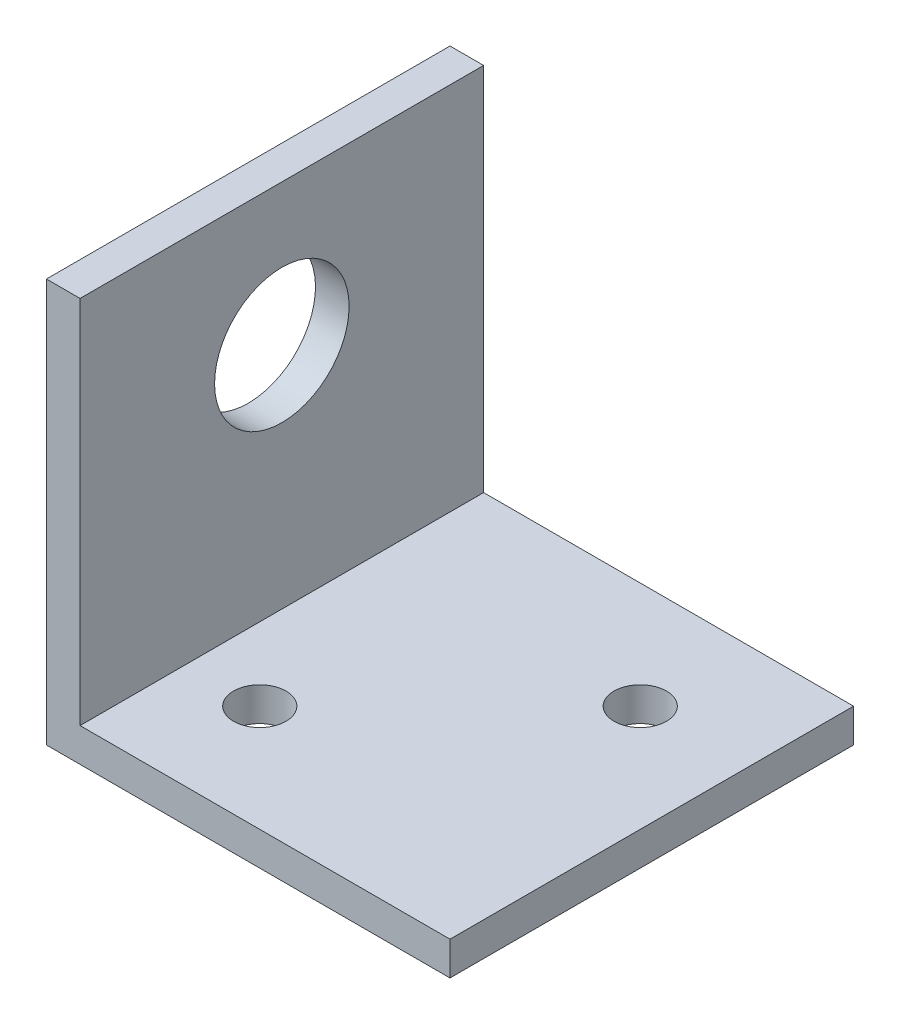
ISO-10303-21;
HEADER;
FILE_DESCRIPTION(('STEP AP214'),'2;1');
FILE_NAME('part.step','',(''),(''),'','','');
FILE_SCHEMA(('AUTOMOTIVE_DESIGN { 1 0 10303 214 1 1 1 1 }'));
ENDSEC;
DATA;
#1=APPLICATION_CONTEXT('core data for automotive mechanical design processes');
#2=APPLICATION_PROTOCOL_DEFINITION('international standard','automotive_design',2000,#1);
#3=PRODUCT_CONTEXT('',#1,'mechanical');
#4=PRODUCT('Part','Part','',(#3));
#5=PRODUCT_RELATED_PRODUCT_CATEGORY('part','',(#4));
#6=PRODUCT_DEFINITION_FORMATION('','',#4);
#7=PRODUCT_DEFINITION_CONTEXT('part definition',#1,'design');
#8=PRODUCT_DEFINITION('design','',#6,#7);
#9=PRODUCT_DEFINITION_SHAPE('','',#8);
#10=(LENGTH_UNIT() NAMED_UNIT(*) SI_UNIT(.MILLI.,.METRE.));
#11=(NAMED_UNIT(*) PLANE_ANGLE_UNIT() SI_UNIT($,.RADIAN.));
#12=(NAMED_UNIT(*) SI_UNIT($,.STERADIAN.) SOLID_ANGLE_UNIT());
#13=UNCERTAINTY_MEASURE_WITH_UNIT(LENGTH_MEASURE(1.E-05),#10,'distance_accuracy_value','');
#14=(GEOMETRIC_REPRESENTATION_CONTEXT(3) GLOBAL_UNCERTAINTY_ASSIGNED_CONTEXT((#13)) GLOBAL_UNIT_ASSIGNED_CONTEXT((#10,
#11,#12)) REPRESENTATION_CONTEXT('',''));
#15=CARTESIAN_POINT('',(0.,0.,0.));
#16=DIRECTION('',(0.,0.,1.));
#17=DIRECTION('',(1.,0.,0.));
#18=AXIS2_PLACEMENT_3D('',#15,#16,#17);
#19=CARTESIAN_POINT('',(0.,0.,38.1));
#20=DIRECTION('',(0.,1.,0.));
#21=DIRECTION('',(0.,0.,1.));
#22=AXIS2_PLACEMENT_3D('',#19,#20,#21);
#23=PLANE('',#22);
#24=CARTESIAN_POINT('',(10.0697438789308,0.,28.0302561210691));
#25=DIRECTION('',(0.,-1.,0.));
#26=DIRECTION('',(0.,0.,-1.));
#27=AXIS2_PLACEMENT_3D('',#24,#25,#26);
#28=CIRCLE('',#27,2.4765);
#29=CARTESIAN_POINT('',(10.0697438789308,0.,25.5537561210691));
#30=VERTEX_POINT('',#29);
#31=EDGE_CURVE('E135',#30,#30,#28,.T.);
#32=ORIENTED_EDGE('',*,*,#31,.F.);
#33=EDGE_LOOP('',(#32));
#34=FACE_BOUND('',#33,.T.);
#35=CARTESIAN_POINT('',(28.0302561210692,0.,10.0697438789309));
#36=DIRECTION('',(0.,-1.,0.));
#37=DIRECTION('',(0.,0.,-1.));
#38=AXIS2_PLACEMENT_3D('',#35,#36,#37);
#39=CIRCLE('',#38,2.4765);
#40=CARTESIAN_POINT('',(28.0302561210692,0.,7.5932438789309));
#41=VERTEX_POINT('',#40);
#42=EDGE_CURVE('E141',#41,#41,#39,.T.);
#43=ORIENTED_EDGE('',*,*,#42,.F.);
#44=EDGE_LOOP('',(#43));
#45=FACE_BOUND('',#44,.T.);
#46=DIRECTION('',(1.,0.,0.));
#47=VECTOR('',#46,1.);
#48=CARTESIAN_POINT('',(0.,0.,0.));
#49=LINE('',#48,#47);
#50=CARTESIAN_POINT('',(0.,0.,0.));
#51=VERTEX_POINT('',#50);
#52=CARTESIAN_POINT('',(38.1,0.,0.));
#53=VERTEX_POINT('',#52);
#54=EDGE_CURVE('E116',#51,#53,#49,.T.);
#55=ORIENTED_EDGE('',*,*,#54,.T.);
#56=DIRECTION('',(0.,0.,-1.));
#57=VECTOR('',#56,1.);
#58=CARTESIAN_POINT('',(38.1,0.,38.1));
#59=LINE('',#58,#57);
#60=CARTESIAN_POINT('',(38.1,0.,38.1));
#61=VERTEX_POINT('',#60);
#62=EDGE_CURVE('E11',#61,#53,#59,.T.);
#63=ORIENTED_EDGE('',*,*,#62,.F.);
#64=DIRECTION('',(1.,0.,0.));
#65=VECTOR('',#64,1.);
#66=CARTESIAN_POINT('',(0.,0.,38.1));
#67=LINE('',#66,#65);
#68=CARTESIAN_POINT('',(0.,0.,38.1));
#69=VERTEX_POINT('',#68);
#70=EDGE_CURVE('E81',#69,#61,#67,.T.);
#71=ORIENTED_EDGE('',*,*,#70,.F.);
#72=DIRECTION('',(0.,0.,-1.));
#73=VECTOR('',#72,1.);
#74=CARTESIAN_POINT('',(0.,0.,38.1));
#75=LINE('',#74,#73);
#76=EDGE_CURVE('E112',#69,#51,#75,.T.);
#77=ORIENTED_EDGE('',*,*,#76,.T.);
#78=EDGE_LOOP('',(#55,#63,#71,#77));
#79=FACE_BOUND('',#78,.T.);
#80=ADVANCED_FACE('F33',(#34,#45,#79),#23,.F.);
#81=CARTESIAN_POINT('',(38.1,3.175,38.1));
#82=DIRECTION('',(1.,0.,0.));
#83=DIRECTION('',(0.,0.,-1.));
#84=AXIS2_PLACEMENT_3D('',#81,#82,#83);
#85=PLANE('',#84);
#86=DIRECTION('',(0.,-1.,0.));
#87=VECTOR('',#86,1.);
#88=CARTESIAN_POINT('',(38.1,3.175,0.));
#89=LINE('',#88,#87);
#90=CARTESIAN_POINT('',(38.1,3.175,0.));
#91=VERTEX_POINT('',#90);
#92=EDGE_CURVE('E119',#91,#53,#89,.T.);
#93=ORIENTED_EDGE('',*,*,#92,.F.);
#94=DIRECTION('',(0.,0.,-1.));
#95=VECTOR('',#94,1.);
#96=CARTESIAN_POINT('',(38.1,3.175,38.1));
#97=LINE('',#96,#95);
#98=CARTESIAN_POINT('',(38.1,3.175,38.1));
#99=VERTEX_POINT('',#98);
#100=EDGE_CURVE('E42',#99,#91,#97,.T.);
#101=ORIENTED_EDGE('',*,*,#100,.F.);
#102=DIRECTION('',(0.,-1.,0.));
#103=VECTOR('',#102,1.);
#104=CARTESIAN_POINT('',(38.1,3.175,38.1));
#105=LINE('',#104,#103);
#106=EDGE_CURVE('E153',#99,#61,#105,.T.);
#107=ORIENTED_EDGE('',*,*,#106,.T.);
#108=ORIENTED_EDGE('',*,*,#62,.T.);
#109=EDGE_LOOP('',(#93,#101,#107,#108));
#110=FACE_BOUND('',#109,.T.);
#111=ADVANCED_FACE('F176',(#110),#85,.T.);
#112=CARTESIAN_POINT('',(0.,3.175,38.1));
#113=DIRECTION('',(0.,1.,0.));
#114=DIRECTION('',(0.,0.,1.));
#115=AXIS2_PLACEMENT_3D('',#112,#113,#114);
#116=PLANE('',#115);
#117=CARTESIAN_POINT('',(10.0697438789308,3.175,28.0302561210691));
#118=DIRECTION('',(0.,1.,0.));
#119=DIRECTION('',(0.,0.,1.));
#120=AXIS2_PLACEMENT_3D('',#117,#118,#119);
#121=CIRCLE('',#120,2.4765);
#122=CARTESIAN_POINT('',(10.0697438789308,3.175,30.5067561210691));
#123=VERTEX_POINT('',#122);
#124=EDGE_CURVE('E36',#123,#123,#121,.T.);
#125=ORIENTED_EDGE('',*,*,#124,.F.);
#126=EDGE_LOOP('',(#125));
#127=FACE_BOUND('',#126,.T.);
#128=CARTESIAN_POINT('',(28.0302561210692,3.175,10.0697438789309));
#129=DIRECTION('',(0.,1.,0.));
#130=DIRECTION('',(0.,0.,1.));
#131=AXIS2_PLACEMENT_3D('',#128,#129,#130);
#132=CIRCLE('',#131,2.4765);
#133=CARTESIAN_POINT('',(28.0302561210692,3.175,12.5462438789309));
#134=VERTEX_POINT('',#133);
#135=EDGE_CURVE('E133',#134,#134,#132,.T.);
#136=ORIENTED_EDGE('',*,*,#135,.F.);
#137=EDGE_LOOP('',(#136));
#138=FACE_BOUND('',#137,.T.);
#139=DIRECTION('',(1.,0.,0.));
#140=VECTOR('',#139,1.);
#141=CARTESIAN_POINT('',(0.,3.175,0.));
#142=LINE('',#141,#140);
#143=CARTESIAN_POINT('',(3.175,3.175,0.));
#144=VERTEX_POINT('',#143);
#145=EDGE_CURVE('E123',#144,#91,#142,.T.);
#146=ORIENTED_EDGE('',*,*,#145,.F.);
#147=DIRECTION('',(0.,0.,-1.));
#148=VECTOR('',#147,1.);
#149=CARTESIAN_POINT('',(3.175,3.175,38.1));
#150=LINE('',#149,#148);
#151=CARTESIAN_POINT('',(3.175,3.175,38.1));
#152=VERTEX_POINT('',#151);
#153=EDGE_CURVE('E102',#152,#144,#150,.T.);
#154=ORIENTED_EDGE('',*,*,#153,.F.);
#155=DIRECTION('',(1.,0.,0.));
#156=VECTOR('',#155,1.);
#157=CARTESIAN_POINT('',(0.,3.175,38.1));
#158=LINE('',#157,#156);
#159=EDGE_CURVE('E108',#152,#99,#158,.T.);
#160=ORIENTED_EDGE('',*,*,#159,.T.);
#161=ORIENTED_EDGE('',*,*,#100,.T.);
#162=EDGE_LOOP('',(#146,#154,#160,#161));
#163=FACE_BOUND('',#162,.T.);
#164=ADVANCED_FACE('F157',(#127,#138,#163),#116,.T.);
#165=CARTESIAN_POINT('',(3.175,38.1,38.1));
#166=DIRECTION('',(1.,0.,0.));
#167=DIRECTION('',(0.,1.,0.));
#168=AXIS2_PLACEMENT_3D('',#165,#166,#167);
#169=PLANE('',#168);
#170=CARTESIAN_POINT('',(3.17500000000001,24.765,19.05));
#171=DIRECTION('',(1.,0.,0.));
#172=DIRECTION('',(0.,1.,0.));
#173=AXIS2_PLACEMENT_3D('',#170,#171,#172);
#174=CIRCLE('',#173,6.35);
#175=CARTESIAN_POINT('',(3.17500000000001,31.115,19.05));
#176=VERTEX_POINT('',#175);
#177=EDGE_CURVE('E120',#176,#176,#174,.T.);
#178=ORIENTED_EDGE('',*,*,#177,.F.);
#179=EDGE_LOOP('',(#178));
#180=FACE_BOUND('',#179,.T.);
#181=DIRECTION('',(0.,-1.,0.));
#182=VECTOR('',#181,1.);
#183=CARTESIAN_POINT('',(3.175,38.1,0.));
#184=LINE('',#183,#182);
#185=CARTESIAN_POINT('',(3.175,38.1,0.));
#186=VERTEX_POINT('',#185);
#187=EDGE_CURVE('E97',#186,#144,#184,.T.);
#188=ORIENTED_EDGE('',*,*,#187,.F.);
#189=DIRECTION('',(0.,0.,-1.));
#190=VECTOR('',#189,1.);
#191=CARTESIAN_POINT('',(3.175,38.1,38.1));
#192=LINE('',#191,#190);
#193=CARTESIAN_POINT('',(3.175,38.1,38.1));
#194=VERTEX_POINT('',#193);
#195=EDGE_CURVE('E92',#194,#186,#192,.T.);
#196=ORIENTED_EDGE('',*,*,#195,.F.);
#197=DIRECTION('',(0.,-1.,0.));
#198=VECTOR('',#197,1.);
#199=CARTESIAN_POINT('',(3.175,38.1,38.1));
#200=LINE('',#199,#198);
#201=EDGE_CURVE('E95',#194,#152,#200,.T.);
#202=ORIENTED_EDGE('',*,*,#201,.T.);
#203=ORIENTED_EDGE('',*,*,#153,.T.);
#204=EDGE_LOOP('',(#188,#196,#202,#203));
#205=FACE_BOUND('',#204,.T.);
#206=ADVANCED_FACE('F94',(#180,#205),#169,.T.);
#207=CARTESIAN_POINT('',(0.,38.1,38.1));
#208=DIRECTION('',(0.,1.,0.));
#209=DIRECTION('',(0.,0.,1.));
#210=AXIS2_PLACEMENT_3D('',#207,#208,#209);
#211=PLANE('',#210);
#212=DIRECTION('',(1.,0.,0.));
#213=VECTOR('',#212,1.);
#214=CARTESIAN_POINT('',(0.,38.1,0.));
#215=LINE('',#214,#213);
#216=CARTESIAN_POINT('',(0.,38.1,0.));
#217=VERTEX_POINT('',#216);
#218=EDGE_CURVE('E127',#217,#186,#215,.T.);
#219=ORIENTED_EDGE('',*,*,#218,.F.);
#220=DIRECTION('',(0.,0.,-1.));
#221=VECTOR('',#220,1.);
#222=CARTESIAN_POINT('',(0.,38.1,38.1));
#223=LINE('',#222,#221);
#224=CARTESIAN_POINT('',(0.,38.1,38.1));
#225=VERTEX_POINT('',#224);
#226=EDGE_CURVE('E72',#225,#217,#223,.T.);
#227=ORIENTED_EDGE('',*,*,#226,.F.);
#228=DIRECTION('',(1.,0.,0.));
#229=VECTOR('',#228,1.);
#230=CARTESIAN_POINT('',(0.,38.1,38.1));
#231=LINE('',#230,#229);
#232=EDGE_CURVE('E106',#225,#194,#231,.T.);
#233=ORIENTED_EDGE('',*,*,#232,.T.);
#234=ORIENTED_EDGE('',*,*,#195,.T.);
#235=EDGE_LOOP('',(#219,#227,#233,#234));
#236=FACE_BOUND('',#235,.T.);
#237=ADVANCED_FACE('F110',(#236),#211,.T.);
#238=CARTESIAN_POINT('',(0.,38.1,38.1));
#239=DIRECTION('',(1.,0.,0.));
#240=DIRECTION('',(0.,1.,0.));
#241=AXIS2_PLACEMENT_3D('',#238,#239,#240);
#242=PLANE('',#241);
#243=CARTESIAN_POINT('',(0.,24.765,19.05));
#244=DIRECTION('',(-1.,0.,0.));
#245=DIRECTION('',(0.,-1.,0.));
#246=AXIS2_PLACEMENT_3D('',#243,#244,#245);
#247=CIRCLE('',#246,6.35);
#248=CARTESIAN_POINT('',(0.,18.415,19.05));
#249=VERTEX_POINT('',#248);
#250=EDGE_CURVE('E139',#249,#249,#247,.T.);
#251=ORIENTED_EDGE('',*,*,#250,.F.);
#252=EDGE_LOOP('',(#251));
#253=FACE_BOUND('',#252,.T.);
#254=DIRECTION('',(0.,-1.,0.));
#255=VECTOR('',#254,1.);
#256=CARTESIAN_POINT('',(0.,38.1,0.));
#257=LINE('',#256,#255);
#258=EDGE_CURVE('E75',#217,#51,#257,.T.);
#259=ORIENTED_EDGE('',*,*,#258,.T.);
#260=ORIENTED_EDGE('',*,*,#76,.F.);
#261=DIRECTION('',(0.,-1.,0.));
#262=VECTOR('',#261,1.);
#263=CARTESIAN_POINT('',(0.,38.1,38.1));
#264=LINE('',#263,#262);
#265=EDGE_CURVE('E51',#225,#69,#264,.T.);
#266=ORIENTED_EDGE('',*,*,#265,.F.);
#267=ORIENTED_EDGE('',*,*,#226,.T.);
#268=EDGE_LOOP('',(#259,#260,#266,#267));
#269=FACE_BOUND('',#268,.T.);
#270=ADVANCED_FACE('F163',(#253,#269),#242,.F.);
#271=CARTESIAN_POINT('',(0.,0.,38.1));
#272=DIRECTION('',(0.,0.,-1.));
#273=DIRECTION('',(-1.,0.,0.));
#274=AXIS2_PLACEMENT_3D('',#271,#272,#273);
#275=PLANE('',#274);
#276=ORIENTED_EDGE('',*,*,#70,.T.);
#277=ORIENTED_EDGE('',*,*,#106,.F.);
#278=ORIENTED_EDGE('',*,*,#159,.F.);
#279=ORIENTED_EDGE('',*,*,#201,.F.);
#280=ORIENTED_EDGE('',*,*,#232,.F.);
#281=ORIENTED_EDGE('',*,*,#265,.T.);
#282=EDGE_LOOP('',(#276,#277,#278,#279,#280,#281));
#283=FACE_BOUND('',#282,.T.);
#284=ADVANCED_FACE('F105',(#283),#275,.F.);
#285=CARTESIAN_POINT('',(0.,0.,0.));
#286=DIRECTION('',(0.,0.,-1.));
#287=DIRECTION('',(-1.,0.,0.));
#288=AXIS2_PLACEMENT_3D('',#285,#286,#287);
#289=PLANE('',#288);
#290=ORIENTED_EDGE('',*,*,#54,.F.);
#291=ORIENTED_EDGE('',*,*,#258,.F.);
#292=ORIENTED_EDGE('',*,*,#218,.T.);
#293=ORIENTED_EDGE('',*,*,#187,.T.);
#294=ORIENTED_EDGE('',*,*,#145,.T.);
#295=ORIENTED_EDGE('',*,*,#92,.T.);
#296=EDGE_LOOP('',(#290,#291,#292,#293,#294,#295));
#297=FACE_BOUND('',#296,.T.);
#298=ADVANCED_FACE('F161',(#297),#289,.T.);
#299=CARTESIAN_POINT('',(38.1,24.765,19.05));
#300=DIRECTION('',(-1.,0.,0.));
#301=DIRECTION('',(0.,-1.,0.));
#302=AXIS2_PLACEMENT_3D('',#299,#300,#301);
#303=CYLINDRICAL_SURFACE('',#302,6.35);
#304=ORIENTED_EDGE('',*,*,#177,.T.);
#305=EDGE_LOOP('',(#304));
#306=FACE_BOUND('',#305,.T.);
#307=ORIENTED_EDGE('',*,*,#250,.T.);
#308=EDGE_LOOP('',(#307));
#309=FACE_BOUND('',#308,.T.);
#310=ADVANCED_FACE('F188',(#306,#309),#303,.F.);
#311=CARTESIAN_POINT('',(28.0302561210692,38.1,10.0697438789309));
#312=DIRECTION('',(0.,-1.,0.));
#313=DIRECTION('',(0.,0.,-1.));
#314=AXIS2_PLACEMENT_3D('',#311,#312,#313);
#315=CYLINDRICAL_SURFACE('',#314,2.4765);
#316=ORIENTED_EDGE('',*,*,#135,.T.);
#317=EDGE_LOOP('',(#316));
#318=FACE_BOUND('',#317,.T.);
#319=ORIENTED_EDGE('',*,*,#42,.T.);
#320=EDGE_LOOP('',(#319));
#321=FACE_BOUND('',#320,.T.);
#322=ADVANCED_FACE('F185',(#318,#321),#315,.F.);
#323=CARTESIAN_POINT('',(10.0697438789308,38.1,28.0302561210691));
#324=DIRECTION('',(0.,-1.,0.));
#325=DIRECTION('',(0.,0.,-1.));
#326=AXIS2_PLACEMENT_3D('',#323,#324,#325);
#327=CYLINDRICAL_SURFACE('',#326,2.4765);
#328=ORIENTED_EDGE('',*,*,#124,.T.);
#329=EDGE_LOOP('',(#328));
#330=FACE_BOUND('',#329,.T.);
#331=ORIENTED_EDGE('',*,*,#31,.T.);
#332=EDGE_LOOP('',(#331));
#333=FACE_BOUND('',#332,.T.);
#334=ADVANCED_FACE('F187',(#330,#333),#327,.F.);
#335=CLOSED_SHELL('',(#80,#111,#164,#206,#237,#270,#284,#298,#310,#322,#334));
#336=MANIFOLD_SOLID_BREP('B2',#335);
#337=ADVANCED_BREP_SHAPE_REPRESENTATION('',(#18,#336),#14);
#338=SHAPE_DEFINITION_REPRESENTATION(#9,#337);
ENDSEC;
END-ISO-10303-21;
